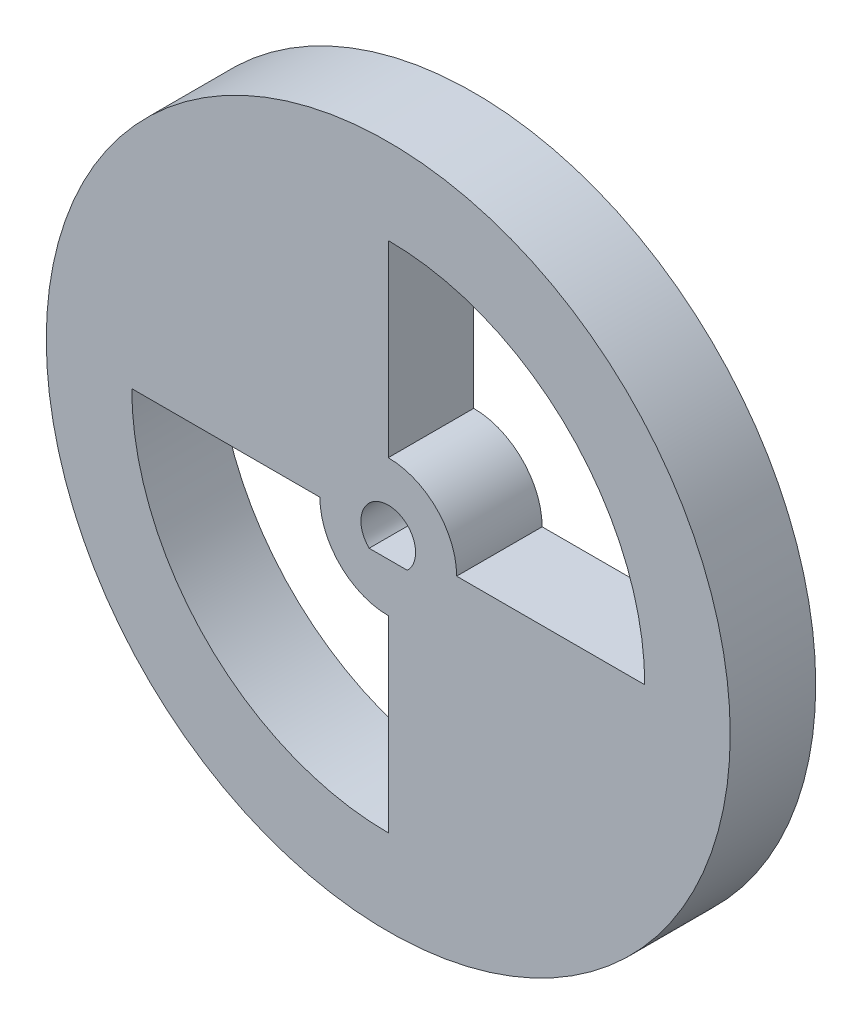
ISO-10303-21;
HEADER;
FILE_DESCRIPTION(('STEP AP214'),'2;1');
FILE_NAME('part.step','',(''),(''),'','','');
FILE_SCHEMA(('AUTOMOTIVE_DESIGN { 1 0 10303 214 1 1 1 1 }'));
ENDSEC;
DATA;
#1=APPLICATION_CONTEXT('core data for automotive mechanical design processes');
#2=APPLICATION_PROTOCOL_DEFINITION('international standard','automotive_design',2000,#1);
#3=PRODUCT_CONTEXT('',#1,'mechanical');
#4=PRODUCT('Part','Part','',(#3));
#5=PRODUCT_RELATED_PRODUCT_CATEGORY('part','',(#4));
#6=PRODUCT_DEFINITION_FORMATION('','',#4);
#7=PRODUCT_DEFINITION_CONTEXT('part definition',#1,'design');
#8=PRODUCT_DEFINITION('design','',#6,#7);
#9=PRODUCT_DEFINITION_SHAPE('','',#8);
#10=(LENGTH_UNIT() NAMED_UNIT(*) SI_UNIT(.MILLI.,.METRE.));
#11=(NAMED_UNIT(*) PLANE_ANGLE_UNIT() SI_UNIT($,.RADIAN.));
#12=(NAMED_UNIT(*) SI_UNIT($,.STERADIAN.) SOLID_ANGLE_UNIT());
#13=UNCERTAINTY_MEASURE_WITH_UNIT(LENGTH_MEASURE(1.E-05),#10,'distance_accuracy_value','');
#14=(GEOMETRIC_REPRESENTATION_CONTEXT(3) GLOBAL_UNCERTAINTY_ASSIGNED_CONTEXT((#13)) GLOBAL_UNIT_ASSIGNED_CONTEXT((#10,
#11,#12)) REPRESENTATION_CONTEXT('',''));
#15=CARTESIAN_POINT('',(0.,0.,0.));
#16=DIRECTION('',(0.,0.,1.));
#17=DIRECTION('',(1.,0.,0.));
#18=AXIS2_PLACEMENT_3D('',#15,#16,#17);
#19=CARTESIAN_POINT('',(-48.7632085705228,20.1445518671911,4.99999988824129));
#20=DIRECTION('',(0.,0.,-1.));
#21=DIRECTION('',(-1.,0.,0.));
#22=AXIS2_PLACEMENT_3D('',#19,#20,#21);
#23=CYLINDRICAL_SURFACE('',#22,20.);
#24=CARTESIAN_POINT('',(-48.7632085705228,20.1445518671911,4.99999988824129));
#25=DIRECTION('',(0.,0.,-1.));
#26=DIRECTION('',(-1.,0.,0.));
#27=AXIS2_PLACEMENT_3D('',#24,#25,#26);
#28=CIRCLE('',#27,20.);
#29=CARTESIAN_POINT('',(-68.7632085705228,20.1445518671911,4.99999988824129));
#30=VERTEX_POINT('',#29);
#31=EDGE_CURVE('E11',#30,#30,#28,.T.);
#32=ORIENTED_EDGE('',*,*,#31,.T.);
#33=EDGE_LOOP('',(#32));
#34=FACE_BOUND('',#33,.T.);
#35=CARTESIAN_POINT('',(-48.7632085705228,20.1445518671911,0.));
#36=DIRECTION('',(0.,0.,-1.));
#37=DIRECTION('',(-1.,0.,0.));
#38=AXIS2_PLACEMENT_3D('',#35,#36,#37);
#39=CIRCLE('',#38,20.);
#40=CARTESIAN_POINT('',(-68.7632085705228,20.1445518671911,0.));
#41=VERTEX_POINT('',#40);
#42=EDGE_CURVE('E37',#41,#41,#39,.T.);
#43=ORIENTED_EDGE('',*,*,#42,.F.);
#44=EDGE_LOOP('',(#43));
#45=FACE_BOUND('',#44,.T.);
#46=ADVANCED_FACE('F34',(#34,#45),#23,.T.);
#47=CARTESIAN_POINT('',(-48.7632085705228,20.1445518671911,4.99999988824129));
#48=DIRECTION('',(0.,0.,-1.));
#49=DIRECTION('',(-1.,0.,0.));
#50=AXIS2_PLACEMENT_3D('',#47,#48,#49);
#51=PLANE('',#50);
#52=DIRECTION('',(0.,1.,0.));
#53=VECTOR('',#52,1.);
#54=CARTESIAN_POINT('',(-48.7632085705228,24.1445518671911,4.99999988824129));
#55=LINE('',#54,#53);
#56=CARTESIAN_POINT('',(-48.7632085705228,24.1445518671911,4.99999988824129));
#57=VERTEX_POINT('',#56);
#58=CARTESIAN_POINT('',(-48.7632085705228,35.1445518671911,4.99999988824129));
#59=VERTEX_POINT('',#58);
#60=EDGE_CURVE('E118',#57,#59,#55,.T.);
#61=ORIENTED_EDGE('',*,*,#60,.T.);
#62=CARTESIAN_POINT('',(-48.7632085705228,20.1445518671911,4.99999988824129));
#63=DIRECTION('',(0.,0.,-1.));
#64=DIRECTION('',(-1.,0.,0.));
#65=AXIS2_PLACEMENT_3D('',#62,#63,#64);
#66=CIRCLE('',#65,15.);
#67=CARTESIAN_POINT('',(-33.7632085705228,20.1445518671911,4.99999988824129));
#68=VERTEX_POINT('',#67);
#69=EDGE_CURVE('E112',#59,#68,#66,.T.);
#70=ORIENTED_EDGE('',*,*,#69,.T.);
#71=DIRECTION('',(-1.,0.,0.));
#72=VECTOR('',#71,1.);
#73=CARTESIAN_POINT('',(-44.7632085705228,20.1445518671911,4.99999988824129));
#74=LINE('',#73,#72);
#75=CARTESIAN_POINT('',(-44.7632085705228,20.1445518671911,4.99999988824129));
#76=VERTEX_POINT('',#75);
#77=EDGE_CURVE('E121',#68,#76,#74,.T.);
#78=ORIENTED_EDGE('',*,*,#77,.T.);
#79=CARTESIAN_POINT('',(-48.7632085705228,20.1445518671911,4.99999988824129));
#80=DIRECTION('',(0.,0.,1.));
#81=DIRECTION('',(-1.,0.,0.));
#82=AXIS2_PLACEMENT_3D('',#79,#80,#81);
#83=CIRCLE('',#82,4.);
#84=EDGE_CURVE('E48',#76,#57,#83,.T.);
#85=ORIENTED_EDGE('',*,*,#84,.T.);
#86=EDGE_LOOP('',(#61,#70,#78,#85));
#87=FACE_BOUND('',#86,.T.);
#88=DIRECTION('',(1.,0.,0.));
#89=VECTOR('',#88,1.);
#90=CARTESIAN_POINT('',(-63.7632085705228,20.1445518671911,4.99999988824129));
#91=LINE('',#90,#89);
#92=CARTESIAN_POINT('',(-63.7632085705228,20.1445518671911,4.99999988824129));
#93=VERTEX_POINT('',#92);
#94=CARTESIAN_POINT('',(-52.7632085705228,20.1445518671911,4.99999988824129));
#95=VERTEX_POINT('',#94);
#96=EDGE_CURVE('E157',#93,#95,#91,.T.);
#97=ORIENTED_EDGE('',*,*,#96,.T.);
#98=CARTESIAN_POINT('',(-48.7632085705228,20.1445518671911,4.99999988824129));
#99=DIRECTION('',(0.,0.,1.));
#100=DIRECTION('',(-1.,0.,0.));
#101=AXIS2_PLACEMENT_3D('',#98,#99,#100);
#102=CIRCLE('',#101,4.);
#103=CARTESIAN_POINT('',(-48.7632085705228,16.1445518671911,4.99999988824129));
#104=VERTEX_POINT('',#103);
#105=EDGE_CURVE('E147',#95,#104,#102,.T.);
#106=ORIENTED_EDGE('',*,*,#105,.T.);
#107=DIRECTION('',(0.,-1.,0.));
#108=VECTOR('',#107,1.);
#109=CARTESIAN_POINT('',(-48.7632085705228,5.14455186719112,4.99999988824129));
#110=LINE('',#109,#108);
#111=CARTESIAN_POINT('',(-48.7632085705228,5.14455186719112,4.99999988824129));
#112=VERTEX_POINT('',#111);
#113=EDGE_CURVE('E150',#104,#112,#110,.T.);
#114=ORIENTED_EDGE('',*,*,#113,.T.);
#115=CARTESIAN_POINT('',(-48.7632085705228,20.1445518671911,4.99999988824129));
#116=DIRECTION('',(0.,0.,-1.));
#117=DIRECTION('',(-1.,0.,0.));
#118=AXIS2_PLACEMENT_3D('',#115,#116,#117);
#119=CIRCLE('',#118,15.);
#120=EDGE_CURVE('E154',#112,#93,#119,.T.);
#121=ORIENTED_EDGE('',*,*,#120,.T.);
#122=EDGE_LOOP('',(#97,#106,#114,#121));
#123=FACE_BOUND('',#122,.T.);
#124=DIRECTION('',(-1.,0.,0.));
#125=VECTOR('',#124,1.);
#126=CARTESIAN_POINT('',(-47.6451745817729,18.9999995529652,4.99999988824129));
#127=LINE('',#126,#125);
#128=CARTESIAN_POINT('',(-47.6451745817729,18.9999995529652,4.99999988824129));
#129=VERTEX_POINT('',#128);
#130=CARTESIAN_POINT('',(-49.8812425592727,18.9999995529652,4.99999988824129));
#131=VERTEX_POINT('',#130);
#132=EDGE_CURVE('E182',#129,#131,#127,.T.);
#133=ORIENTED_EDGE('',*,*,#132,.T.);
#134=CARTESIAN_POINT('',(-48.7632085705228,20.1445518671911,4.99999988824129));
#135=DIRECTION('',(0.,0.,-1.));
#136=DIRECTION('',(-1.,0.,0.));
#137=AXIS2_PLACEMENT_3D('',#134,#135,#136);
#138=CIRCLE('',#137,1.6);
#139=EDGE_CURVE('E179',#131,#129,#138,.T.);
#140=ORIENTED_EDGE('',*,*,#139,.T.);
#141=EDGE_LOOP('',(#133,#140));
#142=FACE_BOUND('',#141,.T.);
#143=ORIENTED_EDGE('',*,*,#31,.F.);
#144=EDGE_LOOP('',(#143));
#145=FACE_BOUND('',#144,.T.);
#146=ADVANCED_FACE('F125',(#87,#123,#142,#145),#51,.F.);
#147=CARTESIAN_POINT('',(-48.7632085705228,20.1445518671911,0.));
#148=DIRECTION('',(0.,0.,-1.));
#149=DIRECTION('',(-1.,0.,0.));
#150=AXIS2_PLACEMENT_3D('',#147,#148,#149);
#151=PLANE('',#150);
#152=CARTESIAN_POINT('',(-48.7632085705228,20.1445518671911,0.));
#153=DIRECTION('',(0.,0.,-1.));
#154=DIRECTION('',(-1.,0.,0.));
#155=AXIS2_PLACEMENT_3D('',#152,#153,#154);
#156=CIRCLE('',#155,15.);
#157=CARTESIAN_POINT('',(-48.7632085705228,35.1445518671911,0.));
#158=VERTEX_POINT('',#157);
#159=CARTESIAN_POINT('',(-33.7632085705228,20.1445518671911,0.));
#160=VERTEX_POINT('',#159);
#161=EDGE_CURVE('E56',#158,#160,#156,.T.);
#162=ORIENTED_EDGE('',*,*,#161,.F.);
#163=DIRECTION('',(0.,1.,0.));
#164=VECTOR('',#163,1.);
#165=CARTESIAN_POINT('',(-48.7632085705228,24.1445518671911,0.));
#166=LINE('',#165,#164);
#167=CARTESIAN_POINT('',(-48.7632085705228,24.1445518671911,0.));
#168=VERTEX_POINT('',#167);
#169=EDGE_CURVE('E128',#168,#158,#166,.T.);
#170=ORIENTED_EDGE('',*,*,#169,.F.);
#171=CARTESIAN_POINT('',(-48.7632085705228,20.1445518671911,0.));
#172=DIRECTION('',(0.,0.,1.));
#173=DIRECTION('',(-1.,0.,0.));
#174=AXIS2_PLACEMENT_3D('',#171,#172,#173);
#175=CIRCLE('',#174,4.);
#176=CARTESIAN_POINT('',(-44.7632085705228,20.1445518671911,0.));
#177=VERTEX_POINT('',#176);
#178=EDGE_CURVE('E131',#177,#168,#175,.T.);
#179=ORIENTED_EDGE('',*,*,#178,.F.);
#180=DIRECTION('',(-1.,0.,0.));
#181=VECTOR('',#180,1.);
#182=CARTESIAN_POINT('',(-44.7632085705228,20.1445518671911,0.));
#183=LINE('',#182,#181);
#184=EDGE_CURVE('E137',#160,#177,#183,.T.);
#185=ORIENTED_EDGE('',*,*,#184,.F.);
#186=EDGE_LOOP('',(#162,#170,#179,#185));
#187=FACE_BOUND('',#186,.T.);
#188=CARTESIAN_POINT('',(-48.7632085705228,20.1445518671911,0.));
#189=DIRECTION('',(0.,0.,1.));
#190=DIRECTION('',(-1.,0.,0.));
#191=AXIS2_PLACEMENT_3D('',#188,#189,#190);
#192=CIRCLE('',#191,4.);
#193=CARTESIAN_POINT('',(-52.7632085705228,20.1445518671911,0.));
#194=VERTEX_POINT('',#193);
#195=CARTESIAN_POINT('',(-48.7632085705228,16.1445518671911,0.));
#196=VERTEX_POINT('',#195);
#197=EDGE_CURVE('E143',#194,#196,#192,.T.);
#198=ORIENTED_EDGE('',*,*,#197,.F.);
#199=DIRECTION('',(1.,0.,0.));
#200=VECTOR('',#199,1.);
#201=CARTESIAN_POINT('',(-63.7632085705228,20.1445518671911,0.));
#202=LINE('',#201,#200);
#203=CARTESIAN_POINT('',(-63.7632085705228,20.1445518671911,0.));
#204=VERTEX_POINT('',#203);
#205=EDGE_CURVE('E151',#204,#194,#202,.T.);
#206=ORIENTED_EDGE('',*,*,#205,.F.);
#207=CARTESIAN_POINT('',(-48.7632085705228,20.1445518671911,0.));
#208=DIRECTION('',(0.,0.,-1.));
#209=DIRECTION('',(-1.,0.,0.));
#210=AXIS2_PLACEMENT_3D('',#207,#208,#209);
#211=CIRCLE('',#210,15.);
#212=CARTESIAN_POINT('',(-48.7632085705228,5.14455186719112,0.));
#213=VERTEX_POINT('',#212);
#214=EDGE_CURVE('E165',#213,#204,#211,.T.);
#215=ORIENTED_EDGE('',*,*,#214,.F.);
#216=DIRECTION('',(0.,-1.,0.));
#217=VECTOR('',#216,1.);
#218=CARTESIAN_POINT('',(-48.7632085705228,5.14455186719112,0.));
#219=LINE('',#218,#217);
#220=EDGE_CURVE('E162',#196,#213,#219,.T.);
#221=ORIENTED_EDGE('',*,*,#220,.F.);
#222=EDGE_LOOP('',(#198,#206,#215,#221));
#223=FACE_BOUND('',#222,.T.);
#224=CARTESIAN_POINT('',(-48.7632085705228,20.1445518671911,0.));
#225=DIRECTION('',(0.,0.,-1.));
#226=DIRECTION('',(-1.,0.,0.));
#227=AXIS2_PLACEMENT_3D('',#224,#225,#226);
#228=CIRCLE('',#227,1.6);
#229=CARTESIAN_POINT('',(-49.8812425592727,18.9999995529652,0.));
#230=VERTEX_POINT('',#229);
#231=CARTESIAN_POINT('',(-47.6451745817729,18.9999995529652,0.));
#232=VERTEX_POINT('',#231);
#233=EDGE_CURVE('E172',#230,#232,#228,.T.);
#234=ORIENTED_EDGE('',*,*,#233,.F.);
#235=DIRECTION('',(-1.,0.,0.));
#236=VECTOR('',#235,1.);
#237=CARTESIAN_POINT('',(-47.6451745817729,18.9999995529652,0.));
#238=LINE('',#237,#236);
#239=EDGE_CURVE('E183',#232,#230,#238,.T.);
#240=ORIENTED_EDGE('',*,*,#239,.F.);
#241=EDGE_LOOP('',(#234,#240));
#242=FACE_BOUND('',#241,.T.);
#243=ORIENTED_EDGE('',*,*,#42,.T.);
#244=EDGE_LOOP('',(#243));
#245=FACE_BOUND('',#244,.T.);
#246=ADVANCED_FACE('F201',(#187,#223,#242,#245),#151,.T.);
#247=CARTESIAN_POINT('',(-48.7632085705228,20.1445518671911,4.99999988824129));
#248=DIRECTION('',(0.,0.,-1.));
#249=DIRECTION('',(-1.,0.,0.));
#250=AXIS2_PLACEMENT_3D('',#247,#248,#249);
#251=CYLINDRICAL_SURFACE('',#250,1.6);
#252=ORIENTED_EDGE('',*,*,#233,.T.);
#253=DIRECTION('',(0.,0.,-1.));
#254=VECTOR('',#253,1.);
#255=CARTESIAN_POINT('',(-47.6451745817729,18.9999995529652,4.99999988824129));
#256=LINE('',#255,#254);
#257=EDGE_CURVE('E186',#129,#232,#256,.T.);
#258=ORIENTED_EDGE('',*,*,#257,.F.);
#259=ORIENTED_EDGE('',*,*,#139,.F.);
#260=DIRECTION('',(0.,0.,-1.));
#261=VECTOR('',#260,1.);
#262=CARTESIAN_POINT('',(-49.8812425592727,18.9999995529652,4.99999988824129));
#263=LINE('',#262,#261);
#264=EDGE_CURVE('E190',#131,#230,#263,.T.);
#265=ORIENTED_EDGE('',*,*,#264,.T.);
#266=EDGE_LOOP('',(#252,#258,#259,#265));
#267=FACE_BOUND('',#266,.T.);
#268=ADVANCED_FACE('F203',(#267),#251,.F.);
#269=CARTESIAN_POINT('',(-47.6451745817729,18.9999995529652,4.99999988824129));
#270=DIRECTION('',(0.,-1.,0.));
#271=DIRECTION('',(0.,0.,-1.));
#272=AXIS2_PLACEMENT_3D('',#269,#270,#271);
#273=PLANE('',#272);
#274=ORIENTED_EDGE('',*,*,#239,.T.);
#275=ORIENTED_EDGE('',*,*,#264,.F.);
#276=ORIENTED_EDGE('',*,*,#132,.F.);
#277=ORIENTED_EDGE('',*,*,#257,.T.);
#278=EDGE_LOOP('',(#274,#275,#276,#277));
#279=FACE_BOUND('',#278,.T.);
#280=ADVANCED_FACE('F196',(#279),#273,.F.);
#281=CARTESIAN_POINT('',(-48.7632085705228,20.1445518671911,4.99999988824129));
#282=DIRECTION('',(0.,0.,-1.));
#283=DIRECTION('',(-1.,0.,0.));
#284=AXIS2_PLACEMENT_3D('',#281,#282,#283);
#285=CYLINDRICAL_SURFACE('',#284,4.);
#286=ORIENTED_EDGE('',*,*,#197,.T.);
#287=DIRECTION('',(0.,0.,-1.));
#288=VECTOR('',#287,1.);
#289=CARTESIAN_POINT('',(-48.7632085705228,16.1445518671911,4.99999988824129));
#290=LINE('',#289,#288);
#291=EDGE_CURVE('E160',#104,#196,#290,.T.);
#292=ORIENTED_EDGE('',*,*,#291,.F.);
#293=ORIENTED_EDGE('',*,*,#105,.F.);
#294=DIRECTION('',(0.,0.,-1.));
#295=VECTOR('',#294,1.);
#296=CARTESIAN_POINT('',(-52.7632085705228,20.1445518671911,4.99999988824129));
#297=LINE('',#296,#295);
#298=EDGE_CURVE('E170',#95,#194,#297,.T.);
#299=ORIENTED_EDGE('',*,*,#298,.T.);
#300=EDGE_LOOP('',(#286,#292,#293,#299));
#301=FACE_BOUND('',#300,.T.);
#302=ADVANCED_FACE('F224',(#301),#285,.T.);
#303=CARTESIAN_POINT('',(-63.7632085705228,20.1445518671911,4.99999988824129));
#304=DIRECTION('',(0.,1.,0.));
#305=DIRECTION('',(0.,0.,1.));
#306=AXIS2_PLACEMENT_3D('',#303,#304,#305);
#307=PLANE('',#306);
#308=ORIENTED_EDGE('',*,*,#205,.T.);
#309=ORIENTED_EDGE('',*,*,#298,.F.);
#310=ORIENTED_EDGE('',*,*,#96,.F.);
#311=DIRECTION('',(0.,0.,-1.));
#312=VECTOR('',#311,1.);
#313=CARTESIAN_POINT('',(-63.7632085705228,20.1445518671911,4.99999988824129));
#314=LINE('',#313,#312);
#315=EDGE_CURVE('E173',#93,#204,#314,.T.);
#316=ORIENTED_EDGE('',*,*,#315,.T.);
#317=EDGE_LOOP('',(#308,#309,#310,#316));
#318=FACE_BOUND('',#317,.T.);
#319=ADVANCED_FACE('F227',(#318),#307,.F.);
#320=CARTESIAN_POINT('',(-48.7632085705228,20.1445518671911,4.99999988824129));
#321=DIRECTION('',(0.,0.,-1.));
#322=DIRECTION('',(-1.,0.,0.));
#323=AXIS2_PLACEMENT_3D('',#320,#321,#322);
#324=CYLINDRICAL_SURFACE('',#323,15.);
#325=ORIENTED_EDGE('',*,*,#214,.T.);
#326=ORIENTED_EDGE('',*,*,#315,.F.);
#327=ORIENTED_EDGE('',*,*,#120,.F.);
#328=DIRECTION('',(0.,0.,-1.));
#329=VECTOR('',#328,1.);
#330=CARTESIAN_POINT('',(-48.7632085705228,5.14455186719112,4.99999988824129));
#331=LINE('',#330,#329);
#332=EDGE_CURVE('E175',#112,#213,#331,.T.);
#333=ORIENTED_EDGE('',*,*,#332,.T.);
#334=EDGE_LOOP('',(#325,#326,#327,#333));
#335=FACE_BOUND('',#334,.T.);
#336=ADVANCED_FACE('F232',(#335),#324,.F.);
#337=CARTESIAN_POINT('',(-48.7632085705228,5.14455186719112,4.99999988824129));
#338=DIRECTION('',(1.,0.,0.));
#339=DIRECTION('',(0.,0.,-1.));
#340=AXIS2_PLACEMENT_3D('',#337,#338,#339);
#341=PLANE('',#340);
#342=ORIENTED_EDGE('',*,*,#220,.T.);
#343=ORIENTED_EDGE('',*,*,#332,.F.);
#344=ORIENTED_EDGE('',*,*,#113,.F.);
#345=ORIENTED_EDGE('',*,*,#291,.T.);
#346=EDGE_LOOP('',(#342,#343,#344,#345));
#347=FACE_BOUND('',#346,.T.);
#348=ADVANCED_FACE('F229',(#347),#341,.F.);
#349=CARTESIAN_POINT('',(-48.7632085705228,20.1445518671911,4.99999988824129));
#350=DIRECTION('',(0.,0.,-1.));
#351=DIRECTION('',(-1.,0.,0.));
#352=AXIS2_PLACEMENT_3D('',#349,#350,#351);
#353=CYLINDRICAL_SURFACE('',#352,15.);
#354=ORIENTED_EDGE('',*,*,#161,.T.);
#355=DIRECTION('',(0.,0.,-1.));
#356=VECTOR('',#355,1.);
#357=CARTESIAN_POINT('',(-33.7632085705228,20.1445518671911,4.99999988824129));
#358=LINE('',#357,#356);
#359=EDGE_CURVE('E108',#68,#160,#358,.T.);
#360=ORIENTED_EDGE('',*,*,#359,.F.);
#361=ORIENTED_EDGE('',*,*,#69,.F.);
#362=DIRECTION('',(0.,0.,-1.));
#363=VECTOR('',#362,1.);
#364=CARTESIAN_POINT('',(-48.7632085705228,35.1445518671911,4.99999988824129));
#365=LINE('',#364,#363);
#366=EDGE_CURVE('E141',#59,#158,#365,.T.);
#367=ORIENTED_EDGE('',*,*,#366,.T.);
#368=EDGE_LOOP('',(#354,#360,#361,#367));
#369=FACE_BOUND('',#368,.T.);
#370=ADVANCED_FACE('F110',(#369),#353,.F.);
#371=CARTESIAN_POINT('',(-48.7632085705228,24.1445518671911,4.99999988824129));
#372=DIRECTION('',(-1.,0.,0.));
#373=DIRECTION('',(0.,0.,1.));
#374=AXIS2_PLACEMENT_3D('',#371,#372,#373);
#375=PLANE('',#374);
#376=ORIENTED_EDGE('',*,*,#169,.T.);
#377=ORIENTED_EDGE('',*,*,#366,.F.);
#378=ORIENTED_EDGE('',*,*,#60,.F.);
#379=DIRECTION('',(0.,0.,-1.));
#380=VECTOR('',#379,1.);
#381=CARTESIAN_POINT('',(-48.7632085705228,24.1445518671911,4.99999988824129));
#382=LINE('',#381,#380);
#383=EDGE_CURVE('E144',#57,#168,#382,.T.);
#384=ORIENTED_EDGE('',*,*,#383,.T.);
#385=EDGE_LOOP('',(#376,#377,#378,#384));
#386=FACE_BOUND('',#385,.T.);
#387=ADVANCED_FACE('F242',(#386),#375,.F.);
#388=CARTESIAN_POINT('',(-48.7632085705228,20.1445518671911,4.99999988824129));
#389=DIRECTION('',(0.,0.,-1.));
#390=DIRECTION('',(-1.,0.,0.));
#391=AXIS2_PLACEMENT_3D('',#388,#389,#390);
#392=CYLINDRICAL_SURFACE('',#391,4.);
#393=ORIENTED_EDGE('',*,*,#178,.T.);
#394=ORIENTED_EDGE('',*,*,#383,.F.);
#395=ORIENTED_EDGE('',*,*,#84,.F.);
#396=DIRECTION('',(0.,0.,-1.));
#397=VECTOR('',#396,1.);
#398=CARTESIAN_POINT('',(-44.7632085705228,20.1445518671911,4.99999988824129));
#399=LINE('',#398,#397);
#400=EDGE_CURVE('E117',#76,#177,#399,.T.);
#401=ORIENTED_EDGE('',*,*,#400,.T.);
#402=EDGE_LOOP('',(#393,#394,#395,#401));
#403=FACE_BOUND('',#402,.T.);
#404=ADVANCED_FACE('F245',(#403),#392,.T.);
#405=CARTESIAN_POINT('',(-44.7632085705228,20.1445518671911,4.99999988824129));
#406=DIRECTION('',(0.,-1.,0.));
#407=DIRECTION('',(0.,0.,-1.));
#408=AXIS2_PLACEMENT_3D('',#405,#406,#407);
#409=PLANE('',#408);
#410=ORIENTED_EDGE('',*,*,#184,.T.);
#411=ORIENTED_EDGE('',*,*,#400,.F.);
#412=ORIENTED_EDGE('',*,*,#77,.F.);
#413=ORIENTED_EDGE('',*,*,#359,.T.);
#414=EDGE_LOOP('',(#410,#411,#412,#413));
#415=FACE_BOUND('',#414,.T.);
#416=ADVANCED_FACE('F122',(#415),#409,.F.);
#417=CLOSED_SHELL('',(#46,#146,#246,#268,#280,#302,#319,#336,#348,#370,#387,#404,#416));
#418=MANIFOLD_SOLID_BREP('B2',#417);
#419=ADVANCED_BREP_SHAPE_REPRESENTATION('',(#18,#418),#14);
#420=SHAPE_DEFINITION_REPRESENTATION(#9,#419);
ENDSEC;
END-ISO-10303-21;
